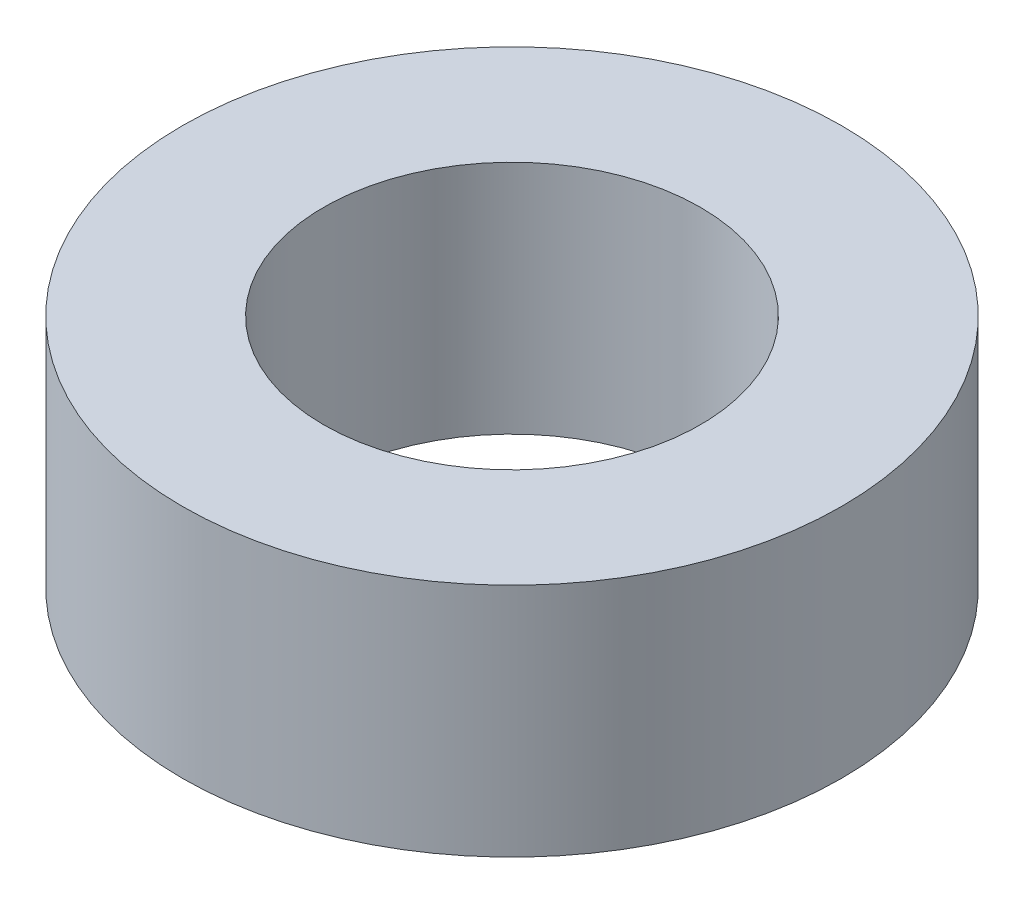
ISO-10303-21;
HEADER;
FILE_DESCRIPTION(('STEP AP214'),'2;1');
FILE_NAME('part.step','',(''),(''),'','','');
FILE_SCHEMA(('AUTOMOTIVE_DESIGN { 1 0 10303 214 1 1 1 1 }'));
ENDSEC;
DATA;
#1=APPLICATION_CONTEXT('core data for automotive mechanical design processes');
#2=APPLICATION_PROTOCOL_DEFINITION('international standard','automotive_design',2000,#1);
#3=PRODUCT_CONTEXT('',#1,'mechanical');
#4=PRODUCT('Part','Part','',(#3));
#5=PRODUCT_RELATED_PRODUCT_CATEGORY('part','',(#4));
#6=PRODUCT_DEFINITION_FORMATION('','',#4);
#7=PRODUCT_DEFINITION_CONTEXT('part definition',#1,'design');
#8=PRODUCT_DEFINITION('design','',#6,#7);
#9=PRODUCT_DEFINITION_SHAPE('','',#8);
#10=(LENGTH_UNIT() NAMED_UNIT(*) SI_UNIT(.MILLI.,.METRE.));
#11=(NAMED_UNIT(*) PLANE_ANGLE_UNIT() SI_UNIT($,.RADIAN.));
#12=(NAMED_UNIT(*) SI_UNIT($,.STERADIAN.) SOLID_ANGLE_UNIT());
#13=UNCERTAINTY_MEASURE_WITH_UNIT(LENGTH_MEASURE(1.E-05),#10,'distance_accuracy_value','');
#14=(GEOMETRIC_REPRESENTATION_CONTEXT(3) GLOBAL_UNCERTAINTY_ASSIGNED_CONTEXT((#13)) GLOBAL_UNIT_ASSIGNED_CONTEXT((#10,
#11,#12)) REPRESENTATION_CONTEXT('',''));
#15=CARTESIAN_POINT('',(0.,0.,0.));
#16=DIRECTION('',(0.,0.,1.));
#17=DIRECTION('',(1.,0.,0.));
#18=AXIS2_PLACEMENT_3D('',#15,#16,#17);
#19=CARTESIAN_POINT('',(0.,2.5,0.));
#20=DIRECTION('',(0.,1.,0.));
#21=DIRECTION('',(0.,0.,1.));
#22=AXIS2_PLACEMENT_3D('',#19,#20,#21);
#23=PLANE('',#22);
#24=CARTESIAN_POINT('',(0.,2.5,0.));
#25=DIRECTION('',(0.,1.,0.));
#26=DIRECTION('',(0.,0.,1.));
#27=AXIS2_PLACEMENT_3D('',#24,#25,#26);
#28=CIRCLE('',#27,3.5);
#29=CARTESIAN_POINT('',(0.,2.5,3.5));
#30=VERTEX_POINT('',#29);
#31=EDGE_CURVE('E11',#30,#30,#28,.T.);
#32=ORIENTED_EDGE('',*,*,#31,.T.);
#33=EDGE_LOOP('',(#32));
#34=FACE_BOUND('',#33,.T.);
#35=CARTESIAN_POINT('',(0.,2.5,0.));
#36=DIRECTION('',(0.,1.,0.));
#37=DIRECTION('',(0.,0.,1.));
#38=AXIS2_PLACEMENT_3D('',#35,#36,#37);
#39=CIRCLE('',#38,2.);
#40=CARTESIAN_POINT('',(0.,2.5,2.));
#41=VERTEX_POINT('',#40);
#42=EDGE_CURVE('E54',#41,#41,#39,.T.);
#43=ORIENTED_EDGE('',*,*,#42,.F.);
#44=EDGE_LOOP('',(#43));
#45=FACE_BOUND('',#44,.T.);
#46=ADVANCED_FACE('F43',(#34,#45),#23,.T.);
#47=CARTESIAN_POINT('',(0.,0.,0.));
#48=DIRECTION('',(0.,1.,0.));
#49=DIRECTION('',(0.,0.,1.));
#50=AXIS2_PLACEMENT_3D('',#47,#48,#49);
#51=PLANE('',#50);
#52=CARTESIAN_POINT('',(0.,0.,0.));
#53=DIRECTION('',(0.,1.,0.));
#54=DIRECTION('',(0.,0.,1.));
#55=AXIS2_PLACEMENT_3D('',#52,#53,#54);
#56=CIRCLE('',#55,3.5);
#57=CARTESIAN_POINT('',(0.,0.,3.5));
#58=VERTEX_POINT('',#57);
#59=EDGE_CURVE('E47',#58,#58,#56,.T.);
#60=ORIENTED_EDGE('',*,*,#59,.F.);
#61=EDGE_LOOP('',(#60));
#62=FACE_BOUND('',#61,.T.);
#63=CARTESIAN_POINT('',(0.,0.,0.));
#64=DIRECTION('',(0.,1.,0.));
#65=DIRECTION('',(0.,0.,1.));
#66=AXIS2_PLACEMENT_3D('',#63,#64,#65);
#67=CIRCLE('',#66,2.);
#68=CARTESIAN_POINT('',(0.,0.,2.));
#69=VERTEX_POINT('',#68);
#70=EDGE_CURVE('E56',#69,#69,#67,.T.);
#71=ORIENTED_EDGE('',*,*,#70,.T.);
#72=EDGE_LOOP('',(#71));
#73=FACE_BOUND('',#72,.T.);
#74=ADVANCED_FACE('F66',(#62,#73),#51,.F.);
#75=CARTESIAN_POINT('',(0.,2.5,0.));
#76=DIRECTION('',(0.,-1.,0.));
#77=DIRECTION('',(0.,0.,-1.));
#78=AXIS2_PLACEMENT_3D('',#75,#76,#77);
#79=CYLINDRICAL_SURFACE('',#78,3.5);
#80=ORIENTED_EDGE('',*,*,#31,.F.);
#81=EDGE_LOOP('',(#80));
#82=FACE_BOUND('',#81,.T.);
#83=ORIENTED_EDGE('',*,*,#59,.T.);
#84=EDGE_LOOP('',(#83));
#85=FACE_BOUND('',#84,.T.);
#86=ADVANCED_FACE('F45',(#82,#85),#79,.T.);
#87=CARTESIAN_POINT('',(0.,2.5,0.));
#88=DIRECTION('',(0.,-1.,0.));
#89=DIRECTION('',(0.,0.,-1.));
#90=AXIS2_PLACEMENT_3D('',#87,#88,#89);
#91=CYLINDRICAL_SURFACE('',#90,2.);
#92=ORIENTED_EDGE('',*,*,#42,.T.);
#93=EDGE_LOOP('',(#92));
#94=FACE_BOUND('',#93,.T.);
#95=ORIENTED_EDGE('',*,*,#70,.F.);
#96=EDGE_LOOP('',(#95));
#97=FACE_BOUND('',#96,.T.);
#98=ADVANCED_FACE('F62',(#94,#97),#91,.F.);
#99=CLOSED_SHELL('',(#46,#74,#86,#98));
#100=MANIFOLD_SOLID_BREP('B2',#99);
#101=ADVANCED_BREP_SHAPE_REPRESENTATION('',(#18,#100),#14);
#102=SHAPE_DEFINITION_REPRESENTATION(#9,#101);
ENDSEC;
END-ISO-10303-21;
